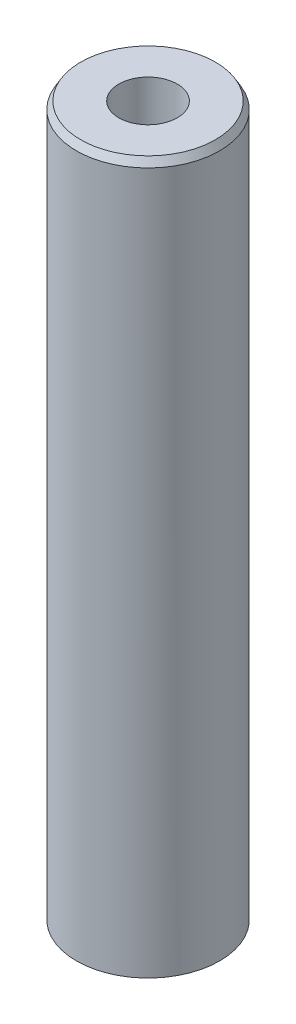
ISO-10303-21;
HEADER;
FILE_DESCRIPTION(('STEP AP214'),'2;1');
FILE_NAME('part.step','',(''),(''),'','','');
FILE_SCHEMA(('AUTOMOTIVE_DESIGN { 1 0 10303 214 1 1 1 1 }'));
ENDSEC;
DATA;
#1=APPLICATION_CONTEXT('core data for automotive mechanical design processes');
#2=APPLICATION_PROTOCOL_DEFINITION('international standard','automotive_design',2000,#1);
#3=PRODUCT_CONTEXT('',#1,'mechanical');
#4=PRODUCT('Part','Part','',(#3));
#5=PRODUCT_RELATED_PRODUCT_CATEGORY('part','',(#4));
#6=PRODUCT_DEFINITION_FORMATION('','',#4);
#7=PRODUCT_DEFINITION_CONTEXT('part definition',#1,'design');
#8=PRODUCT_DEFINITION('design','',#6,#7);
#9=PRODUCT_DEFINITION_SHAPE('','',#8);
#10=(LENGTH_UNIT() NAMED_UNIT(*) SI_UNIT(.MILLI.,.METRE.));
#11=(NAMED_UNIT(*) PLANE_ANGLE_UNIT() SI_UNIT($,.RADIAN.));
#12=(NAMED_UNIT(*) SI_UNIT($,.STERADIAN.) SOLID_ANGLE_UNIT());
#13=UNCERTAINTY_MEASURE_WITH_UNIT(LENGTH_MEASURE(1.E-05),#10,'distance_accuracy_value','');
#14=(GEOMETRIC_REPRESENTATION_CONTEXT(3) GLOBAL_UNCERTAINTY_ASSIGNED_CONTEXT((#13)) GLOBAL_UNIT_ASSIGNED_CONTEXT((#10,
#11,#12)) REPRESENTATION_CONTEXT('',''));
#15=CARTESIAN_POINT('',(0.,0.,0.));
#16=DIRECTION('',(0.,0.,1.));
#17=DIRECTION('',(1.,0.,0.));
#18=AXIS2_PLACEMENT_3D('',#15,#16,#17);
#19=CARTESIAN_POINT('',(0.,473.016388646753,0.));
#20=DIRECTION('',(0.,-1.,0.));
#21=DIRECTION('',(0.,0.,-1.));
#22=AXIS2_PLACEMENT_3D('',#19,#20,#21);
#23=CYLINDRICAL_SURFACE('',#22,47.5);
#24=CARTESIAN_POINT('',(0.,468.081386331932,0.));
#25=DIRECTION('',(0.,1.,0.));
#26=DIRECTION('',(0.,0.,1.));
#27=AXIS2_PLACEMENT_3D('',#24,#25,#26);
#28=CIRCLE('',#27,47.5);
#29=CARTESIAN_POINT('',(0.,468.081386331932,-47.5));
#30=VERTEX_POINT('',#29);
#31=EDGE_CURVE('E50',#30,#30,#28,.F.);
#32=ORIENTED_EDGE('',*,*,#31,.T.);
#33=EDGE_LOOP('',(#32));
#34=FACE_BOUND('',#33,.T.);
#35=CARTESIAN_POINT('',(0.,2.84922491491346,0.));
#36=DIRECTION('',(0.,1.,0.));
#37=DIRECTION('',(0.,0.,1.));
#38=AXIS2_PLACEMENT_3D('',#35,#36,#37);
#39=CIRCLE('',#38,47.5);
#40=CARTESIAN_POINT('',(0.,2.84922491491346,47.5));
#41=VERTEX_POINT('',#40);
#42=EDGE_CURVE('E51',#41,#41,#39,.T.);
#43=ORIENTED_EDGE('',*,*,#42,.T.);
#44=EDGE_LOOP('',(#43));
#45=FACE_BOUND('',#44,.T.);
#46=ADVANCED_FACE('F39',(#34,#45),#23,.T.);
#47=CARTESIAN_POINT('',(0.,473.016388646753,0.));
#48=DIRECTION('',(0.,1.,0.));
#49=DIRECTION('',(0.,0.,1.));
#50=AXIS2_PLACEMENT_3D('',#47,#48,#49);
#51=PLANE('',#50);
#52=CARTESIAN_POINT('',(0.,473.016388646753,0.));
#53=DIRECTION('',(0.,1.,0.));
#54=DIRECTION('',(0.,0.,1.));
#55=AXIS2_PLACEMENT_3D('',#52,#53,#54);
#56=CIRCLE('',#55,44.6507750850866);
#57=CARTESIAN_POINT('',(0.,473.016388646753,-44.6507750850866));
#58=VERTEX_POINT('',#57);
#59=EDGE_CURVE('E54',#58,#58,#56,.T.);
#60=ORIENTED_EDGE('',*,*,#59,.T.);
#61=EDGE_LOOP('',(#60));
#62=FACE_BOUND('',#61,.T.);
#63=CARTESIAN_POINT('',(0.,473.016388646753,0.));
#64=DIRECTION('',(0.,1.,0.));
#65=DIRECTION('',(0.,0.,1.));
#66=AXIS2_PLACEMENT_3D('',#63,#64,#65);
#67=CIRCLE('',#66,19.404010950409);
#68=CARTESIAN_POINT('',(0.,473.016388646753,19.404010950409));
#69=VERTEX_POINT('',#68);
#70=EDGE_CURVE('E58',#69,#69,#67,.T.);
#71=ORIENTED_EDGE('',*,*,#70,.F.);
#72=EDGE_LOOP('',(#71));
#73=FACE_BOUND('',#72,.T.);
#74=ADVANCED_FACE('F69',(#62,#73),#51,.T.);
#75=CARTESIAN_POINT('',(0.,0.,0.));
#76=DIRECTION('',(0.,1.,0.));
#77=DIRECTION('',(0.,0.,1.));
#78=AXIS2_PLACEMENT_3D('',#75,#76,#77);
#79=PLANE('',#78);
#80=CARTESIAN_POINT('',(0.,0.,0.));
#81=DIRECTION('',(0.,1.,0.));
#82=DIRECTION('',(0.,0.,1.));
#83=AXIS2_PLACEMENT_3D('',#80,#81,#82);
#84=CIRCLE('',#83,42.5649976851787);
#85=CARTESIAN_POINT('',(0.,0.,42.5649976851787));
#86=VERTEX_POINT('',#85);
#87=EDGE_CURVE('E10',#86,#86,#84,.F.);
#88=ORIENTED_EDGE('',*,*,#87,.T.);
#89=EDGE_LOOP('',(#88));
#90=FACE_BOUND('',#89,.T.);
#91=CARTESIAN_POINT('',(0.,0.,0.));
#92=DIRECTION('',(0.,1.,0.));
#93=DIRECTION('',(0.,0.,1.));
#94=AXIS2_PLACEMENT_3D('',#91,#92,#93);
#95=CIRCLE('',#94,19.404010950409);
#96=CARTESIAN_POINT('',(0.,0.,19.404010950409));
#97=VERTEX_POINT('',#96);
#98=EDGE_CURVE('E63',#97,#97,#95,.T.);
#99=ORIENTED_EDGE('',*,*,#98,.T.);
#100=EDGE_LOOP('',(#99));
#101=FACE_BOUND('',#100,.T.);
#102=ADVANCED_FACE('F75',(#90,#101),#79,.F.);
#103=CARTESIAN_POINT('',(0.,473.016388646753,0.));
#104=DIRECTION('',(0.,-1.,0.));
#105=DIRECTION('',(0.,0.,-1.));
#106=AXIS2_PLACEMENT_3D('',#103,#104,#105);
#107=CYLINDRICAL_SURFACE('',#106,19.404010950409);
#108=ORIENTED_EDGE('',*,*,#70,.T.);
#109=EDGE_LOOP('',(#108));
#110=FACE_BOUND('',#109,.T.);
#111=ORIENTED_EDGE('',*,*,#98,.F.);
#112=EDGE_LOOP('',(#111));
#113=FACE_BOUND('',#112,.T.);
#114=ADVANCED_FACE('F70',(#110,#113),#107,.F.);
#115=CARTESIAN_POINT('',(0.,473.016388646753,0.));
#116=DIRECTION('',(0.,-1.,0.));
#117=DIRECTION('',(0.,0.,-1.));
#118=AXIS2_PLACEMENT_3D('',#115,#116,#117);
#119=CONICAL_SURFACE('',#118,44.6507750850866,0.523598775598291);
#120=CARTESIAN_POINT('',(0.,468.081386331932,-47.5));
#121=CARTESIAN_POINT('',(0.,468.132792606044,-47.470320573803));
#122=CARTESIAN_POINT('',(0.,468.184198880157,-47.440641147606));
#123=CARTESIAN_POINT('',(0.,468.287011428382,-47.381282295212));
#124=CARTESIAN_POINT('',(0.,468.338417702495,-47.3516028690149));
#125=CARTESIAN_POINT('',(0.,468.441230250721,-47.2922440166209));
#126=CARTESIAN_POINT('',(0.,468.492636524833,-47.2625645904239));
#127=CARTESIAN_POINT('',(0.,468.595449073059,-47.2032057380299));
#128=CARTESIAN_POINT('',(0.,468.646855347171,-47.1735263118329));
#129=CARTESIAN_POINT('',(0.,468.749667895397,-47.1141674594388));
#130=CARTESIAN_POINT('',(0.,468.80107416951,-47.0844880332418));
#131=CARTESIAN_POINT('',(0.,468.903886717735,-47.0251291808478));
#132=CARTESIAN_POINT('',(0.,468.955292991848,-46.9954497546508));
#133=CARTESIAN_POINT('',(0.,469.058105540073,-46.9360909022567));
#134=CARTESIAN_POINT('',(0.,469.109511814186,-46.9064114760597));
#135=CARTESIAN_POINT('',(0.,469.212324362411,-46.8470526236657));
#136=CARTESIAN_POINT('',(0.,469.263730636524,-46.8173731974687));
#137=CARTESIAN_POINT('',(0.,469.36654318475,-46.7580143450746));
#138=CARTESIAN_POINT('',(0.,469.417949458862,-46.7283349188776));
#139=CARTESIAN_POINT('',(0.,469.520762007088,-46.6689760664836));
#140=CARTESIAN_POINT('',(0.,469.572168281201,-46.6392966402866));
#141=CARTESIAN_POINT('',(0.,469.674980829426,-46.5799377878926));
#142=CARTESIAN_POINT('',(0.,469.726387103539,-46.5502583616955));
#143=CARTESIAN_POINT('',(0.,469.829199651764,-46.4908995093015));
#144=CARTESIAN_POINT('',(0.,469.880605925877,-46.4612200831045));
#145=CARTESIAN_POINT('',(0.,469.983418474102,-46.4018612307105));
#146=CARTESIAN_POINT('',(0.,470.034824748215,-46.3721818045134));
#147=CARTESIAN_POINT('',(0.,470.13763729644,-46.3128229521194));
#148=CARTESIAN_POINT('',(0.,470.189043570553,-46.2831435259224));
#149=CARTESIAN_POINT('',(0.,470.291856118779,-46.2237846735284));
#150=CARTESIAN_POINT('',(0.,470.343262392891,-46.1941052473314));
#151=CARTESIAN_POINT('',(0.,470.446074941117,-46.1347463949373));
#152=CARTESIAN_POINT('',(0.,470.497481215229,-46.1050669687403));
#153=CARTESIAN_POINT('',(0.,470.600293763455,-46.0457081163463));
#154=CARTESIAN_POINT('',(0.,470.651700037568,-46.0160286901493));
#155=CARTESIAN_POINT('',(0.,470.754512585793,-45.9566698377552));
#156=CARTESIAN_POINT('',(0.,470.805918859906,-45.9269904115582));
#157=CARTESIAN_POINT('',(0.,470.908731408131,-45.8676315591642));
#158=CARTESIAN_POINT('',(0.,470.960137682244,-45.8379521329672));
#159=CARTESIAN_POINT('',(0.,471.062950230469,-45.7785932805731));
#160=CARTESIAN_POINT('',(0.,471.114356504582,-45.7489138543761));
#161=CARTESIAN_POINT('',(0.,471.217169052808,-45.6895550019821));
#162=CARTESIAN_POINT('',(0.,471.26857532692,-45.6598755757851));
#163=CARTESIAN_POINT('',(0.,471.371387875146,-45.6005167233911));
#164=CARTESIAN_POINT('',(0.,471.422794149258,-45.570837297194));
#165=CARTESIAN_POINT('',(0.,471.525606697484,-45.5114784448));
#166=CARTESIAN_POINT('',(0.,471.577012971597,-45.481799018603));
#167=CARTESIAN_POINT('',(0.,471.679825519822,-45.422440166209));
#168=CARTESIAN_POINT('',(0.,471.731231793935,-45.392760740012));
#169=CARTESIAN_POINT('',(0.,471.83404434216,-45.3334018876179));
#170=CARTESIAN_POINT('',(0.,471.885450616273,-45.3037224614209));
#171=CARTESIAN_POINT('',(0.,471.988263164498,-45.2443636090269));
#172=CARTESIAN_POINT('',(0.,472.039669438611,-45.2146841828299));
#173=CARTESIAN_POINT('',(0.,472.142481986837,-45.1553253304358));
#174=CARTESIAN_POINT('',(0.,472.193888260949,-45.1256459042388));
#175=CARTESIAN_POINT('',(0.,472.296700809175,-45.0662870518448));
#176=CARTESIAN_POINT('',(0.,472.348107083288,-45.0366076256478));
#177=CARTESIAN_POINT('',(0.,472.450919631513,-44.9772487732537));
#178=CARTESIAN_POINT('',(0.,472.502325905626,-44.9475693470567));
#179=CARTESIAN_POINT('',(0.,472.605138453851,-44.8882104946627));
#180=CARTESIAN_POINT('',(0.,472.656544727964,-44.8585310684657));
#181=CARTESIAN_POINT('',(0.,472.759357276189,-44.7991722160716));
#182=CARTESIAN_POINT('',(0.,472.810763550302,-44.7694927898746));
#183=CARTESIAN_POINT('',(0.,472.913576098527,-44.7101339374806));
#184=CARTESIAN_POINT('',(0.,472.96498237264,-44.6804545112836));
#185=CARTESIAN_POINT('',(0.,473.016388646753,-44.6507750850866));
#186=B_SPLINE_CURVE_WITH_KNOTS('',3,(#120,#121,#122,#123,#124,#125,#126,#127,#128,#129,#130,
#131,#132,#133,#134,#135,#136,#137,#138,#139,#140,#141,#142,#143,#144,#145,#146,#147,#148,#149,
#150,#151,#152,#153,#154,#155,#156,#157,#158,#159,#160,#161,#162,#163,#164,#165,#166,#167,#168,
#169,#170,#171,#172,#173,#174,#175,#176,#177,#178,#179,#180,#181,#182,#183,#184,#185),
.UNSPECIFIED.,.F.,.F.,(4,2,2,2,2,2,2,2,2,2,2,2,2,2,2,2,2,2,2,2,2,2,2,2,2,2,2,2,2,2,2,2,4),(0.,
0.178076557182059,0.356153114364166,0.534229671546273,0.712306228728331,0.890382785910438,
1.06845934309254,1.24653590027465,1.42461245745671,1.60268901463881,1.78076557182092,
1.95884212900298,2.13691868618509,2.31499524336719,2.4930718005493,2.67114835773136,
2.84922491491347,3.02730147209557,3.20537802927763,3.38345458645974,3.56153114364185,
3.73960770082395,3.91768425800601,4.09576081518812,4.27383737237023,4.45191392955229,
4.62999048673439,4.8080670439165,4.98614360109861,5.16422015828066,5.34229671546277,
5.52037327264488,5.69844982982699),.UNSPECIFIED.);
#187=EDGE_CURVE('BSEAM81',#30,#58,#186,.T.);
#188=ORIENTED_EDGE('',*,*,#31,.F.);
#189=ORIENTED_EDGE('',*,*,#59,.F.);
#190=ORIENTED_EDGE('',*,*,#187,.T.);
#191=ORIENTED_EDGE('',*,*,#187,.F.);
#192=EDGE_LOOP('',(#188,#190,#189,#191));
#193=FACE_BOUND('',#192,.T.);
#194=ADVANCED_FACE('F81',(#193),#119,.T.);
#195=CARTESIAN_POINT('',(0.,2.84922491491346,0.));
#196=DIRECTION('',(0.,1.,0.));
#197=DIRECTION('',(0.,0.,1.));
#198=AXIS2_PLACEMENT_3D('',#195,#196,#197);
#199=CONICAL_SURFACE('',#198,47.5,1.04719755119661);
#200=ORIENTED_EDGE('',*,*,#87,.F.);
#201=EDGE_LOOP('',(#200));
#202=FACE_BOUND('',#201,.T.);
#203=ORIENTED_EDGE('',*,*,#42,.F.);
#204=EDGE_LOOP('',(#203));
#205=FACE_BOUND('',#204,.T.);
#206=ADVANCED_FACE('F45',(#202,#205),#199,.T.);
#207=CLOSED_SHELL('',(#46,#74,#102,#114,#194,#206));
#208=MANIFOLD_SOLID_BREP('B2',#207);
#209=ADVANCED_BREP_SHAPE_REPRESENTATION('',(#18,#208),#14);
#210=SHAPE_DEFINITION_REPRESENTATION(#9,#209);
ENDSEC;
END-ISO-10303-21;
